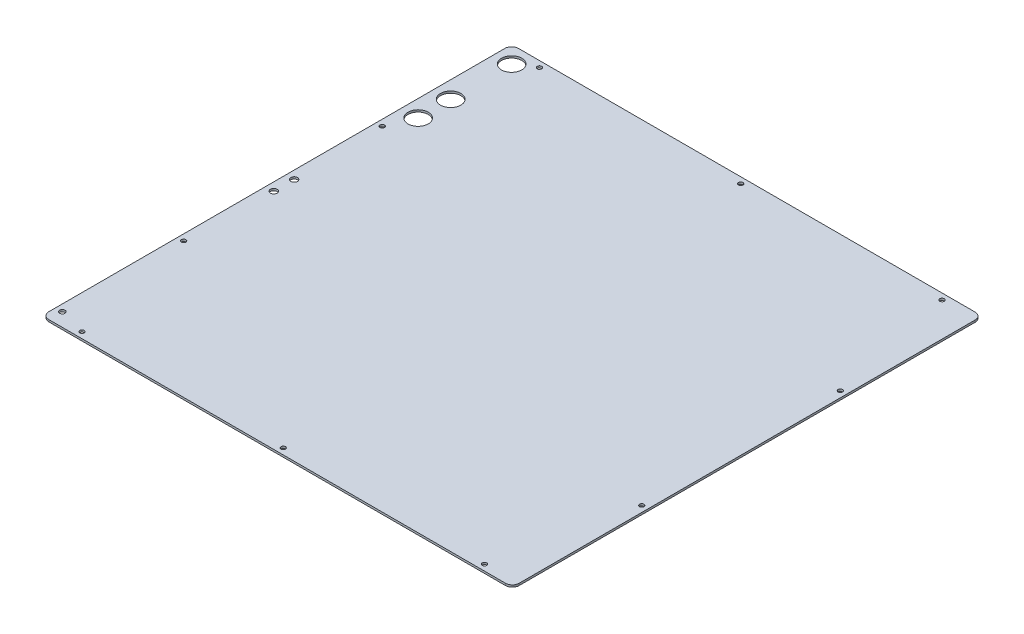
ISO-10303-21;
HEADER;
FILE_DESCRIPTION(('STEP AP214'),'2;1');
FILE_NAME('part.step','',(''),(''),'','','');
FILE_SCHEMA(('AUTOMOTIVE_DESIGN { 1 0 10303 214 1 1 1 1 }'));
ENDSEC;
DATA;
#1=APPLICATION_CONTEXT('core data for automotive mechanical design processes');
#2=APPLICATION_PROTOCOL_DEFINITION('international standard','automotive_design',2000,#1);
#3=PRODUCT_CONTEXT('',#1,'mechanical');
#4=PRODUCT('Part','Part','',(#3));
#5=PRODUCT_RELATED_PRODUCT_CATEGORY('part','',(#4));
#6=PRODUCT_DEFINITION_FORMATION('','',#4);
#7=PRODUCT_DEFINITION_CONTEXT('part definition',#1,'design');
#8=PRODUCT_DEFINITION('design','',#6,#7);
#9=PRODUCT_DEFINITION_SHAPE('','',#8);
#10=(LENGTH_UNIT() NAMED_UNIT(*) SI_UNIT(.MILLI.,.METRE.));
#11=(NAMED_UNIT(*) PLANE_ANGLE_UNIT() SI_UNIT($,.RADIAN.));
#12=(NAMED_UNIT(*) SI_UNIT($,.STERADIAN.) SOLID_ANGLE_UNIT());
#13=UNCERTAINTY_MEASURE_WITH_UNIT(LENGTH_MEASURE(1.E-05),#10,'distance_accuracy_value','');
#14=(GEOMETRIC_REPRESENTATION_CONTEXT(3) GLOBAL_UNCERTAINTY_ASSIGNED_CONTEXT((#13)) GLOBAL_UNIT_ASSIGNED_CONTEXT((#10,
#11,#12)) REPRESENTATION_CONTEXT('',''));
#15=CARTESIAN_POINT('',(0.,0.,0.));
#16=DIRECTION('',(0.,0.,1.));
#17=DIRECTION('',(1.,0.,0.));
#18=AXIS2_PLACEMENT_3D('',#15,#16,#17);
#19=CARTESIAN_POINT('',(-297.,3.,337.5));
#20=DIRECTION('',(0.,1.,0.));
#21=DIRECTION('',(0.,0.,1.));
#22=AXIS2_PLACEMENT_3D('',#19,#20,#21);
#23=CYLINDRICAL_SURFACE('',#22,3.3);
#24=CARTESIAN_POINT('',(-297.,0.,337.5));
#25=DIRECTION('',(0.,1.,0.));
#26=DIRECTION('',(0.,0.,1.));
#27=AXIS2_PLACEMENT_3D('',#24,#25,#26);
#28=CIRCLE('',#27,3.30000000000003);
#29=CARTESIAN_POINT('',(-297.,0.,340.8));
#30=VERTEX_POINT('',#29);
#31=EDGE_CURVE('E147',#30,#30,#28,.T.);
#32=ORIENTED_EDGE('',*,*,#31,.F.);
#33=EDGE_LOOP('',(#32));
#34=FACE_BOUND('',#33,.T.);
#35=CARTESIAN_POINT('',(-297.,3.,337.5));
#36=DIRECTION('',(0.,1.,0.));
#37=DIRECTION('',(0.,0.,1.));
#38=AXIS2_PLACEMENT_3D('',#35,#36,#37);
#39=CIRCLE('',#38,3.29999999999997);
#40=CARTESIAN_POINT('',(-297.,3.,340.8));
#41=VERTEX_POINT('',#40);
#42=EDGE_CURVE('E150',#41,#41,#39,.T.);
#43=ORIENTED_EDGE('',*,*,#42,.T.);
#44=EDGE_LOOP('',(#43));
#45=FACE_BOUND('',#44,.T.);
#46=ADVANCED_FACE('F36',(#34,#45),#23,.F.);
#47=CARTESIAN_POINT('',(-347.,3.,346.5));
#48=DIRECTION('',(1.,0.,0.));
#49=DIRECTION('',(0.,0.,-1.));
#50=AXIS2_PLACEMENT_3D('',#47,#48,#49);
#51=PLANE('',#50);
#52=DIRECTION('',(0.,0.,1.));
#53=VECTOR('',#52,1.);
#54=CARTESIAN_POINT('',(-347.,3.,346.5));
#55=LINE('',#54,#53);
#56=CARTESIAN_POINT('',(-347.,3.,-336.5));
#57=VERTEX_POINT('',#56);
#58=CARTESIAN_POINT('',(-347.,3.,336.5));
#59=VERTEX_POINT('',#58);
#60=EDGE_CURVE('E123',#57,#59,#55,.T.);
#61=ORIENTED_EDGE('',*,*,#60,.F.);
#62=DIRECTION('',(0.,-1.,0.));
#63=VECTOR('',#62,1.);
#64=CARTESIAN_POINT('',(-347.,3.,-336.5));
#65=LINE('',#64,#63);
#66=CARTESIAN_POINT('',(-347.,0.,-336.5));
#67=VERTEX_POINT('',#66);
#68=EDGE_CURVE('E107',#57,#67,#65,.T.);
#69=ORIENTED_EDGE('',*,*,#68,.T.);
#70=DIRECTION('',(0.,0.,1.));
#71=VECTOR('',#70,1.);
#72=CARTESIAN_POINT('',(-347.,0.,346.5));
#73=LINE('',#72,#71);
#74=CARTESIAN_POINT('',(-347.,0.,336.5));
#75=VERTEX_POINT('',#74);
#76=EDGE_CURVE('E120',#67,#75,#73,.T.);
#77=ORIENTED_EDGE('',*,*,#76,.T.);
#78=DIRECTION('',(0.,-1.,0.));
#79=VECTOR('',#78,1.);
#80=CARTESIAN_POINT('',(-347.,3.,336.5));
#81=LINE('',#80,#79);
#82=EDGE_CURVE('E125',#75,#59,#81,.F.);
#83=ORIENTED_EDGE('',*,*,#82,.T.);
#84=EDGE_LOOP('',(#61,#69,#77,#83));
#85=FACE_BOUND('',#84,.T.);
#86=ADVANCED_FACE('F119',(#85),#51,.F.);
#87=CARTESIAN_POINT('',(347.,3.,346.5));
#88=DIRECTION('',(0.,0.,-1.));
#89=DIRECTION('',(-1.,0.,0.));
#90=AXIS2_PLACEMENT_3D('',#87,#88,#89);
#91=PLANE('',#90);
#92=DIRECTION('',(1.,0.,0.));
#93=VECTOR('',#92,1.);
#94=CARTESIAN_POINT('',(347.,3.,346.5));
#95=LINE('',#94,#93);
#96=CARTESIAN_POINT('',(-337.,3.,346.5));
#97=VERTEX_POINT('',#96);
#98=CARTESIAN_POINT('',(337.,3.,346.5));
#99=VERTEX_POINT('',#98);
#100=EDGE_CURVE('E174',#97,#99,#95,.T.);
#101=ORIENTED_EDGE('',*,*,#100,.F.);
#102=DIRECTION('',(0.,-1.,0.));
#103=VECTOR('',#102,1.);
#104=CARTESIAN_POINT('',(-337.,3.,346.5));
#105=LINE('',#104,#103);
#106=CARTESIAN_POINT('',(-337.,0.,346.5));
#107=VERTEX_POINT('',#106);
#108=EDGE_CURVE('E11',#97,#107,#105,.T.);
#109=ORIENTED_EDGE('',*,*,#108,.T.);
#110=DIRECTION('',(1.,0.,0.));
#111=VECTOR('',#110,1.);
#112=CARTESIAN_POINT('',(347.,0.,346.5));
#113=LINE('',#112,#111);
#114=CARTESIAN_POINT('',(337.,0.,346.5));
#115=VERTEX_POINT('',#114);
#116=EDGE_CURVE('E131',#107,#115,#113,.T.);
#117=ORIENTED_EDGE('',*,*,#116,.T.);
#118=DIRECTION('',(0.,-1.,0.));
#119=VECTOR('',#118,1.);
#120=CARTESIAN_POINT('',(337.,3.,346.5));
#121=LINE('',#120,#119);
#122=EDGE_CURVE('E44',#115,#99,#121,.F.);
#123=ORIENTED_EDGE('',*,*,#122,.T.);
#124=EDGE_LOOP('',(#101,#109,#117,#123));
#125=FACE_BOUND('',#124,.T.);
#126=ADVANCED_FACE('F173',(#125),#91,.F.);
#127=CARTESIAN_POINT('',(347.,3.,346.5));
#128=DIRECTION('',(-1.,0.,0.));
#129=DIRECTION('',(0.,0.,1.));
#130=AXIS2_PLACEMENT_3D('',#127,#128,#129);
#131=PLANE('',#130);
#132=DIRECTION('',(0.,0.,-1.));
#133=VECTOR('',#132,1.);
#134=CARTESIAN_POINT('',(347.,0.,346.5));
#135=LINE('',#134,#133);
#136=CARTESIAN_POINT('',(347.,0.,336.5));
#137=VERTEX_POINT('',#136);
#138=CARTESIAN_POINT('',(347.,0.,-336.5));
#139=VERTEX_POINT('',#138);
#140=EDGE_CURVE('E135',#137,#139,#135,.T.);
#141=ORIENTED_EDGE('',*,*,#140,.T.);
#142=DIRECTION('',(0.,-1.,0.));
#143=VECTOR('',#142,1.);
#144=CARTESIAN_POINT('',(347.,3.,-336.5));
#145=LINE('',#144,#143);
#146=CARTESIAN_POINT('',(347.,3.,-336.5));
#147=VERTEX_POINT('',#146);
#148=EDGE_CURVE('E51',#139,#147,#145,.F.);
#149=ORIENTED_EDGE('',*,*,#148,.T.);
#150=DIRECTION('',(0.,0.,-1.));
#151=VECTOR('',#150,1.);
#152=CARTESIAN_POINT('',(347.,3.,346.5));
#153=LINE('',#152,#151);
#154=CARTESIAN_POINT('',(347.,3.,336.5));
#155=VERTEX_POINT('',#154);
#156=EDGE_CURVE('E181',#155,#147,#153,.T.);
#157=ORIENTED_EDGE('',*,*,#156,.F.);
#158=DIRECTION('',(0.,-1.,0.));
#159=VECTOR('',#158,1.);
#160=CARTESIAN_POINT('',(347.,3.,336.5));
#161=LINE('',#160,#159);
#162=EDGE_CURVE('E167',#155,#137,#161,.T.);
#163=ORIENTED_EDGE('',*,*,#162,.T.);
#164=EDGE_LOOP('',(#141,#149,#157,#163));
#165=FACE_BOUND('',#164,.T.);
#166=ADVANCED_FACE('F185',(#165),#131,.F.);
#167=CARTESIAN_POINT('',(347.,3.,-346.5));
#168=DIRECTION('',(0.,0.,1.));
#169=DIRECTION('',(1.,0.,0.));
#170=AXIS2_PLACEMENT_3D('',#167,#168,#169);
#171=PLANE('',#170);
#172=DIRECTION('',(-1.,0.,0.));
#173=VECTOR('',#172,1.);
#174=CARTESIAN_POINT('',(347.,0.,-346.5));
#175=LINE('',#174,#173);
#176=CARTESIAN_POINT('',(337.,0.,-346.5));
#177=VERTEX_POINT('',#176);
#178=CARTESIAN_POINT('',(-337.,0.,-346.5));
#179=VERTEX_POINT('',#178);
#180=EDGE_CURVE('E145',#177,#179,#175,.T.);
#181=ORIENTED_EDGE('',*,*,#180,.T.);
#182=DIRECTION('',(0.,-1.,0.));
#183=VECTOR('',#182,1.);
#184=CARTESIAN_POINT('',(-337.,3.,-346.5));
#185=LINE('',#184,#183);
#186=CARTESIAN_POINT('',(-337.,3.,-346.5));
#187=VERTEX_POINT('',#186);
#188=EDGE_CURVE('E108',#179,#187,#185,.F.);
#189=ORIENTED_EDGE('',*,*,#188,.T.);
#190=DIRECTION('',(-1.,0.,0.));
#191=VECTOR('',#190,1.);
#192=CARTESIAN_POINT('',(347.,3.,-346.5));
#193=LINE('',#192,#191);
#194=CARTESIAN_POINT('',(337.,3.,-346.5));
#195=VERTEX_POINT('',#194);
#196=EDGE_CURVE('E141',#195,#187,#193,.T.);
#197=ORIENTED_EDGE('',*,*,#196,.F.);
#198=DIRECTION('',(0.,-1.,0.));
#199=VECTOR('',#198,1.);
#200=CARTESIAN_POINT('',(337.,3.,-346.5));
#201=LINE('',#200,#199);
#202=EDGE_CURVE('E113',#195,#177,#201,.T.);
#203=ORIENTED_EDGE('',*,*,#202,.T.);
#204=EDGE_LOOP('',(#181,#189,#197,#203));
#205=FACE_BOUND('',#204,.T.);
#206=ADVANCED_FACE('F192',(#205),#171,.F.);
#207=CARTESIAN_POINT('',(0.,3.,0.));
#208=DIRECTION('',(0.,1.,0.));
#209=DIRECTION('',(0.,0.,1.));
#210=AXIS2_PLACEMENT_3D('',#207,#208,#209);
#211=PLANE('',#210);
#212=CARTESIAN_POINT('',(-337.,3.,326.5));
#213=DIRECTION('',(0.,1.,0.));
#214=DIRECTION('',(0.,0.,1.));
#215=AXIS2_PLACEMENT_3D('',#212,#213,#214);
#216=CIRCLE('',#215,3.99999999999999);
#217=CARTESIAN_POINT('',(-337.,3.,330.5));
#218=VERTEX_POINT('',#217);
#219=EDGE_CURVE('E276',#218,#218,#216,.T.);
#220=ORIENTED_EDGE('',*,*,#219,.F.);
#221=EDGE_LOOP('',(#220));
#222=FACE_BOUND('',#221,.T.);
#223=CARTESIAN_POINT('',(-335.,3.,16.5));
#224=DIRECTION('',(0.,1.,0.));
#225=DIRECTION('',(0.,0.,1.));
#226=AXIS2_PLACEMENT_3D('',#223,#224,#225);
#227=CIRCLE('',#226,4.99999999999999);
#228=CARTESIAN_POINT('',(-335.,3.,21.5));
#229=VERTEX_POINT('',#228);
#230=EDGE_CURVE('E270',#229,#229,#227,.T.);
#231=ORIENTED_EDGE('',*,*,#230,.F.);
#232=EDGE_LOOP('',(#231));
#233=FACE_BOUND('',#232,.T.);
#234=CARTESIAN_POINT('',(-335.,3.,-13.5));
#235=DIRECTION('',(0.,1.,0.));
#236=DIRECTION('',(0.,0.,1.));
#237=AXIS2_PLACEMENT_3D('',#234,#235,#236);
#238=CIRCLE('',#237,4.99999999999999);
#239=CARTESIAN_POINT('',(-335.,3.,-8.49999999999999));
#240=VERTEX_POINT('',#239);
#241=EDGE_CURVE('E264',#240,#240,#238,.T.);
#242=ORIENTED_EDGE('',*,*,#241,.F.);
#243=EDGE_LOOP('',(#242));
#244=FACE_BOUND('',#243,.T.);
#245=CARTESIAN_POINT('',(-322.,3.,-183.5));
#246=DIRECTION('',(0.,1.,0.));
#247=DIRECTION('',(0.,0.,1.));
#248=AXIS2_PLACEMENT_3D('',#245,#246,#247);
#249=CIRCLE('',#248,15.);
#250=CARTESIAN_POINT('',(-322.,3.,-168.5));
#251=VERTEX_POINT('',#250);
#252=EDGE_CURVE('E258',#251,#251,#249,.T.);
#253=ORIENTED_EDGE('',*,*,#252,.F.);
#254=EDGE_LOOP('',(#253));
#255=FACE_BOUND('',#254,.T.);
#256=CARTESIAN_POINT('',(-322.,3.,-231.5));
#257=DIRECTION('',(0.,1.,0.));
#258=DIRECTION('',(0.,0.,1.));
#259=AXIS2_PLACEMENT_3D('',#256,#257,#258);
#260=CIRCLE('',#259,15.);
#261=CARTESIAN_POINT('',(-322.,3.,-216.5));
#262=VERTEX_POINT('',#261);
#263=EDGE_CURVE('E252',#262,#262,#260,.T.);
#264=ORIENTED_EDGE('',*,*,#263,.F.);
#265=EDGE_LOOP('',(#264));
#266=FACE_BOUND('',#265,.T.);
#267=CARTESIAN_POINT('',(-322.,3.,-321.5));
#268=DIRECTION('',(0.,1.,0.));
#269=DIRECTION('',(0.,0.,1.));
#270=AXIS2_PLACEMENT_3D('',#267,#268,#269);
#271=CIRCLE('',#270,15.);
#272=CARTESIAN_POINT('',(-322.,3.,-306.5));
#273=VERTEX_POINT('',#272);
#274=EDGE_CURVE('E246',#273,#273,#271,.T.);
#275=ORIENTED_EDGE('',*,*,#274,.F.);
#276=EDGE_LOOP('',(#275));
#277=FACE_BOUND('',#276,.T.);
#278=CARTESIAN_POINT('',(-338.,3.,-146.5));
#279=DIRECTION('',(0.,1.,0.));
#280=DIRECTION('',(0.,0.,1.));
#281=AXIS2_PLACEMENT_3D('',#278,#279,#280);
#282=CIRCLE('',#281,3.29999999999997);
#283=CARTESIAN_POINT('',(-338.,3.,-143.2));
#284=VERTEX_POINT('',#283);
#285=EDGE_CURVE('E242',#284,#284,#282,.T.);
#286=ORIENTED_EDGE('',*,*,#285,.F.);
#287=EDGE_LOOP('',(#286));
#288=FACE_BOUND('',#287,.T.);
#289=CARTESIAN_POINT('',(-338.,3.,146.5));
#290=DIRECTION('',(0.,1.,0.));
#291=DIRECTION('',(0.,0.,1.));
#292=AXIS2_PLACEMENT_3D('',#289,#290,#291);
#293=CIRCLE('',#292,3.29999999999997);
#294=CARTESIAN_POINT('',(-338.,3.,149.8));
#295=VERTEX_POINT('',#294);
#296=EDGE_CURVE('E236',#295,#295,#293,.T.);
#297=ORIENTED_EDGE('',*,*,#296,.F.);
#298=EDGE_LOOP('',(#297));
#299=FACE_BOUND('',#298,.T.);
#300=CARTESIAN_POINT('',(338.,3.,-146.5));
#301=DIRECTION('',(0.,1.,0.));
#302=DIRECTION('',(0.,0.,1.));
#303=AXIS2_PLACEMENT_3D('',#300,#301,#302);
#304=CIRCLE('',#303,3.29999999999997);
#305=CARTESIAN_POINT('',(338.,3.,-143.2));
#306=VERTEX_POINT('',#305);
#307=EDGE_CURVE('E227',#306,#306,#304,.T.);
#308=ORIENTED_EDGE('',*,*,#307,.F.);
#309=EDGE_LOOP('',(#308));
#310=FACE_BOUND('',#309,.T.);
#311=CARTESIAN_POINT('',(338.,3.,146.5));
#312=DIRECTION('',(0.,1.,0.));
#313=DIRECTION('',(0.,0.,1.));
#314=AXIS2_PLACEMENT_3D('',#311,#312,#313);
#315=CIRCLE('',#314,3.29999999999997);
#316=CARTESIAN_POINT('',(338.,3.,149.8));
#317=VERTEX_POINT('',#316);
#318=EDGE_CURVE('E224',#317,#317,#315,.T.);
#319=ORIENTED_EDGE('',*,*,#318,.F.);
#320=EDGE_LOOP('',(#319));
#321=FACE_BOUND('',#320,.T.);
#322=CARTESIAN_POINT('',(-297.,3.,-337.5));
#323=DIRECTION('',(0.,1.,0.));
#324=DIRECTION('',(0.,0.,1.));
#325=AXIS2_PLACEMENT_3D('',#322,#323,#324);
#326=CIRCLE('',#325,3.29999999999997);
#327=CARTESIAN_POINT('',(-297.,3.,-334.2));
#328=VERTEX_POINT('',#327);
#329=EDGE_CURVE('E218',#328,#328,#326,.T.);
#330=ORIENTED_EDGE('',*,*,#329,.F.);
#331=EDGE_LOOP('',(#330));
#332=FACE_BOUND('',#331,.T.);
#333=CARTESIAN_POINT('',(0.,3.,-337.5));
#334=DIRECTION('',(0.,1.,0.));
#335=DIRECTION('',(0.,0.,1.));
#336=AXIS2_PLACEMENT_3D('',#333,#334,#335);
#337=CIRCLE('',#336,3.29999999999999);
#338=CARTESIAN_POINT('',(0.,3.,-334.2));
#339=VERTEX_POINT('',#338);
#340=EDGE_CURVE('E212',#339,#339,#337,.T.);
#341=ORIENTED_EDGE('',*,*,#340,.F.);
#342=EDGE_LOOP('',(#341));
#343=FACE_BOUND('',#342,.T.);
#344=CARTESIAN_POINT('',(297.,3.,-337.5));
#345=DIRECTION('',(0.,1.,0.));
#346=DIRECTION('',(0.,0.,1.));
#347=AXIS2_PLACEMENT_3D('',#344,#345,#346);
#348=CIRCLE('',#347,3.29999999999997);
#349=CARTESIAN_POINT('',(297.,3.,-334.2));
#350=VERTEX_POINT('',#349);
#351=EDGE_CURVE('E206',#350,#350,#348,.T.);
#352=ORIENTED_EDGE('',*,*,#351,.F.);
#353=EDGE_LOOP('',(#352));
#354=FACE_BOUND('',#353,.T.);
#355=CARTESIAN_POINT('',(0.,3.,337.5));
#356=DIRECTION('',(0.,1.,0.));
#357=DIRECTION('',(0.,0.,1.));
#358=AXIS2_PLACEMENT_3D('',#355,#356,#357);
#359=CIRCLE('',#358,3.29999999999997);
#360=CARTESIAN_POINT('',(0.,3.,340.8));
#361=VERTEX_POINT('',#360);
#362=EDGE_CURVE('E197',#361,#361,#359,.T.);
#363=ORIENTED_EDGE('',*,*,#362,.F.);
#364=EDGE_LOOP('',(#363));
#365=FACE_BOUND('',#364,.T.);
#366=CARTESIAN_POINT('',(297.,3.,337.5));
#367=DIRECTION('',(0.,1.,0.));
#368=DIRECTION('',(0.,0.,1.));
#369=AXIS2_PLACEMENT_3D('',#366,#367,#368);
#370=CIRCLE('',#369,3.29999999999997);
#371=CARTESIAN_POINT('',(297.,3.,340.8));
#372=VERTEX_POINT('',#371);
#373=EDGE_CURVE('E138',#372,#372,#370,.T.);
#374=ORIENTED_EDGE('',*,*,#373,.F.);
#375=EDGE_LOOP('',(#374));
#376=FACE_BOUND('',#375,.T.);
#377=ORIENTED_EDGE('',*,*,#196,.T.);
#378=CARTESIAN_POINT('',(-337.,3.,-336.5));
#379=DIRECTION('',(0.,1.,0.));
#380=DIRECTION('',(0.,0.,1.));
#381=AXIS2_PLACEMENT_3D('',#378,#379,#380);
#382=CIRCLE('',#381,10.);
#383=EDGE_CURVE('E165',#187,#57,#382,.T.);
#384=ORIENTED_EDGE('',*,*,#383,.T.);
#385=ORIENTED_EDGE('',*,*,#60,.T.);
#386=CARTESIAN_POINT('',(-337.,3.,336.5));
#387=DIRECTION('',(0.,1.,0.));
#388=DIRECTION('',(0.,0.,1.));
#389=AXIS2_PLACEMENT_3D('',#386,#387,#388);
#390=CIRCLE('',#389,10.);
#391=EDGE_CURVE('E161',#59,#97,#390,.T.);
#392=ORIENTED_EDGE('',*,*,#391,.T.);
#393=ORIENTED_EDGE('',*,*,#100,.T.);
#394=CARTESIAN_POINT('',(337.,3.,336.5));
#395=DIRECTION('',(0.,1.,0.));
#396=DIRECTION('',(0.,0.,1.));
#397=AXIS2_PLACEMENT_3D('',#394,#395,#396);
#398=CIRCLE('',#397,10.);
#399=EDGE_CURVE('E58',#99,#155,#398,.T.);
#400=ORIENTED_EDGE('',*,*,#399,.T.);
#401=ORIENTED_EDGE('',*,*,#156,.T.);
#402=CARTESIAN_POINT('',(337.,3.,-336.5));
#403=DIRECTION('',(0.,1.,0.));
#404=DIRECTION('',(0.,0.,1.));
#405=AXIS2_PLACEMENT_3D('',#402,#403,#404);
#406=CIRCLE('',#405,10.);
#407=EDGE_CURVE('E163',#147,#195,#406,.T.);
#408=ORIENTED_EDGE('',*,*,#407,.T.);
#409=EDGE_LOOP('',(#377,#384,#385,#392,#393,#400,#401,#408));
#410=FACE_BOUND('',#409,.T.);
#411=ORIENTED_EDGE('',*,*,#42,.F.);
#412=EDGE_LOOP('',(#411));
#413=FACE_BOUND('',#412,.T.);
#414=ADVANCED_FACE('F178',(#222,#233,#244,#255,#266,#277,#288,#299,#310,#321,#332,#343,#354,
#365,#376,#410,#413),#211,.T.);
#415=CARTESIAN_POINT('',(0.,0.,0.));
#416=DIRECTION('',(0.,1.,0.));
#417=DIRECTION('',(0.,0.,1.));
#418=AXIS2_PLACEMENT_3D('',#415,#416,#417);
#419=PLANE('',#418);
#420=CARTESIAN_POINT('',(-337.,0.,326.5));
#421=DIRECTION('',(0.,1.,0.));
#422=DIRECTION('',(0.,0.,1.));
#423=AXIS2_PLACEMENT_3D('',#420,#421,#422);
#424=CIRCLE('',#423,3.99999999999999);
#425=CARTESIAN_POINT('',(-337.,0.,330.5));
#426=VERTEX_POINT('',#425);
#427=EDGE_CURVE('E245',#426,#426,#424,.T.);
#428=ORIENTED_EDGE('',*,*,#427,.T.);
#429=EDGE_LOOP('',(#428));
#430=FACE_BOUND('',#429,.T.);
#431=CARTESIAN_POINT('',(-335.,0.,16.5));
#432=DIRECTION('',(0.,1.,0.));
#433=DIRECTION('',(0.,0.,1.));
#434=AXIS2_PLACEMENT_3D('',#431,#432,#433);
#435=CIRCLE('',#434,4.99999999999999);
#436=CARTESIAN_POINT('',(-335.,0.,21.5));
#437=VERTEX_POINT('',#436);
#438=EDGE_CURVE('E273',#437,#437,#435,.T.);
#439=ORIENTED_EDGE('',*,*,#438,.T.);
#440=EDGE_LOOP('',(#439));
#441=FACE_BOUND('',#440,.T.);
#442=CARTESIAN_POINT('',(-335.,0.,-13.5));
#443=DIRECTION('',(0.,1.,0.));
#444=DIRECTION('',(0.,0.,1.));
#445=AXIS2_PLACEMENT_3D('',#442,#443,#444);
#446=CIRCLE('',#445,4.99999999999999);
#447=CARTESIAN_POINT('',(-335.,0.,-8.49999999999999));
#448=VERTEX_POINT('',#447);
#449=EDGE_CURVE('E267',#448,#448,#446,.T.);
#450=ORIENTED_EDGE('',*,*,#449,.T.);
#451=EDGE_LOOP('',(#450));
#452=FACE_BOUND('',#451,.T.);
#453=CARTESIAN_POINT('',(-322.,0.,-183.5));
#454=DIRECTION('',(0.,1.,0.));
#455=DIRECTION('',(0.,0.,1.));
#456=AXIS2_PLACEMENT_3D('',#453,#454,#455);
#457=CIRCLE('',#456,15.);
#458=CARTESIAN_POINT('',(-322.,0.,-168.5));
#459=VERTEX_POINT('',#458);
#460=EDGE_CURVE('E261',#459,#459,#457,.T.);
#461=ORIENTED_EDGE('',*,*,#460,.T.);
#462=EDGE_LOOP('',(#461));
#463=FACE_BOUND('',#462,.T.);
#464=CARTESIAN_POINT('',(-322.,0.,-231.5));
#465=DIRECTION('',(0.,1.,0.));
#466=DIRECTION('',(0.,0.,1.));
#467=AXIS2_PLACEMENT_3D('',#464,#465,#466);
#468=CIRCLE('',#467,15.);
#469=CARTESIAN_POINT('',(-322.,0.,-216.5));
#470=VERTEX_POINT('',#469);
#471=EDGE_CURVE('E255',#470,#470,#468,.T.);
#472=ORIENTED_EDGE('',*,*,#471,.T.);
#473=EDGE_LOOP('',(#472));
#474=FACE_BOUND('',#473,.T.);
#475=CARTESIAN_POINT('',(-322.,0.,-321.5));
#476=DIRECTION('',(0.,1.,0.));
#477=DIRECTION('',(0.,0.,1.));
#478=AXIS2_PLACEMENT_3D('',#475,#476,#477);
#479=CIRCLE('',#478,15.);
#480=CARTESIAN_POINT('',(-322.,0.,-306.5));
#481=VERTEX_POINT('',#480);
#482=EDGE_CURVE('E249',#481,#481,#479,.T.);
#483=ORIENTED_EDGE('',*,*,#482,.T.);
#484=EDGE_LOOP('',(#483));
#485=FACE_BOUND('',#484,.T.);
#486=CARTESIAN_POINT('',(-338.,0.,-146.5));
#487=DIRECTION('',(0.,1.,0.));
#488=DIRECTION('',(0.,0.,1.));
#489=AXIS2_PLACEMENT_3D('',#486,#487,#488);
#490=CIRCLE('',#489,3.30000000000003);
#491=CARTESIAN_POINT('',(-338.,0.,-143.2));
#492=VERTEX_POINT('',#491);
#493=EDGE_CURVE('E239',#492,#492,#490,.T.);
#494=ORIENTED_EDGE('',*,*,#493,.T.);
#495=EDGE_LOOP('',(#494));
#496=FACE_BOUND('',#495,.T.);
#497=CARTESIAN_POINT('',(-338.,0.,146.5));
#498=DIRECTION('',(0.,1.,0.));
#499=DIRECTION('',(0.,0.,1.));
#500=AXIS2_PLACEMENT_3D('',#497,#498,#499);
#501=CIRCLE('',#500,3.30000000000003);
#502=CARTESIAN_POINT('',(-338.,0.,149.8));
#503=VERTEX_POINT('',#502);
#504=EDGE_CURVE('E233',#503,#503,#501,.T.);
#505=ORIENTED_EDGE('',*,*,#504,.T.);
#506=EDGE_LOOP('',(#505));
#507=FACE_BOUND('',#506,.T.);
#508=CARTESIAN_POINT('',(338.,0.,-146.5));
#509=DIRECTION('',(0.,1.,0.));
#510=DIRECTION('',(0.,0.,1.));
#511=AXIS2_PLACEMENT_3D('',#508,#509,#510);
#512=CIRCLE('',#511,3.30000000000003);
#513=CARTESIAN_POINT('',(338.,0.,-143.2));
#514=VERTEX_POINT('',#513);
#515=EDGE_CURVE('E230',#514,#514,#512,.T.);
#516=ORIENTED_EDGE('',*,*,#515,.T.);
#517=EDGE_LOOP('',(#516));
#518=FACE_BOUND('',#517,.T.);
#519=CARTESIAN_POINT('',(338.,0.,146.5));
#520=DIRECTION('',(0.,1.,0.));
#521=DIRECTION('',(0.,0.,1.));
#522=AXIS2_PLACEMENT_3D('',#519,#520,#521);
#523=CIRCLE('',#522,3.30000000000003);
#524=CARTESIAN_POINT('',(338.,0.,149.8));
#525=VERTEX_POINT('',#524);
#526=EDGE_CURVE('E221',#525,#525,#523,.T.);
#527=ORIENTED_EDGE('',*,*,#526,.T.);
#528=EDGE_LOOP('',(#527));
#529=FACE_BOUND('',#528,.T.);
#530=CARTESIAN_POINT('',(-297.,0.,-337.5));
#531=DIRECTION('',(0.,1.,0.));
#532=DIRECTION('',(0.,0.,1.));
#533=AXIS2_PLACEMENT_3D('',#530,#531,#532);
#534=CIRCLE('',#533,3.30000000000003);
#535=CARTESIAN_POINT('',(-297.,0.,-334.2));
#536=VERTEX_POINT('',#535);
#537=EDGE_CURVE('E215',#536,#536,#534,.T.);
#538=ORIENTED_EDGE('',*,*,#537,.T.);
#539=EDGE_LOOP('',(#538));
#540=FACE_BOUND('',#539,.T.);
#541=CARTESIAN_POINT('',(0.,0.,-337.5));
#542=DIRECTION('',(0.,1.,0.));
#543=DIRECTION('',(0.,0.,1.));
#544=AXIS2_PLACEMENT_3D('',#541,#542,#543);
#545=CIRCLE('',#544,3.3);
#546=CARTESIAN_POINT('',(0.,0.,-334.2));
#547=VERTEX_POINT('',#546);
#548=EDGE_CURVE('E209',#547,#547,#545,.T.);
#549=ORIENTED_EDGE('',*,*,#548,.T.);
#550=EDGE_LOOP('',(#549));
#551=FACE_BOUND('',#550,.T.);
#552=CARTESIAN_POINT('',(297.,0.,-337.5));
#553=DIRECTION('',(0.,1.,0.));
#554=DIRECTION('',(0.,0.,1.));
#555=AXIS2_PLACEMENT_3D('',#552,#553,#554);
#556=CIRCLE('',#555,3.30000000000003);
#557=CARTESIAN_POINT('',(297.,0.,-334.2));
#558=VERTEX_POINT('',#557);
#559=EDGE_CURVE('E203',#558,#558,#556,.T.);
#560=ORIENTED_EDGE('',*,*,#559,.T.);
#561=EDGE_LOOP('',(#560));
#562=FACE_BOUND('',#561,.T.);
#563=CARTESIAN_POINT('',(0.,0.,337.5));
#564=DIRECTION('',(0.,1.,0.));
#565=DIRECTION('',(0.,0.,1.));
#566=AXIS2_PLACEMENT_3D('',#563,#564,#565);
#567=CIRCLE('',#566,3.30000000000003);
#568=CARTESIAN_POINT('',(0.,0.,340.8));
#569=VERTEX_POINT('',#568);
#570=EDGE_CURVE('E200',#569,#569,#567,.T.);
#571=ORIENTED_EDGE('',*,*,#570,.T.);
#572=EDGE_LOOP('',(#571));
#573=FACE_BOUND('',#572,.T.);
#574=CARTESIAN_POINT('',(297.,0.,337.5));
#575=DIRECTION('',(0.,1.,0.));
#576=DIRECTION('',(0.,0.,1.));
#577=AXIS2_PLACEMENT_3D('',#574,#575,#576);
#578=CIRCLE('',#577,3.30000000000003);
#579=CARTESIAN_POINT('',(297.,0.,340.8));
#580=VERTEX_POINT('',#579);
#581=EDGE_CURVE('E132',#580,#580,#578,.T.);
#582=ORIENTED_EDGE('',*,*,#581,.T.);
#583=EDGE_LOOP('',(#582));
#584=FACE_BOUND('',#583,.T.);
#585=ORIENTED_EDGE('',*,*,#76,.F.);
#586=CARTESIAN_POINT('',(-337.,0.,-336.5));
#587=DIRECTION('',(0.,1.,0.));
#588=DIRECTION('',(0.,0.,1.));
#589=AXIS2_PLACEMENT_3D('',#586,#587,#588);
#590=CIRCLE('',#589,10.);
#591=EDGE_CURVE('E103',#67,#179,#590,.F.);
#592=ORIENTED_EDGE('',*,*,#591,.T.);
#593=ORIENTED_EDGE('',*,*,#180,.F.);
#594=CARTESIAN_POINT('',(337.,0.,-336.5));
#595=DIRECTION('',(0.,1.,0.));
#596=DIRECTION('',(0.,0.,1.));
#597=AXIS2_PLACEMENT_3D('',#594,#595,#596);
#598=CIRCLE('',#597,10.);
#599=EDGE_CURVE('E114',#177,#139,#598,.F.);
#600=ORIENTED_EDGE('',*,*,#599,.T.);
#601=ORIENTED_EDGE('',*,*,#140,.F.);
#602=CARTESIAN_POINT('',(337.,0.,336.5));
#603=DIRECTION('',(0.,1.,0.));
#604=DIRECTION('',(0.,0.,1.));
#605=AXIS2_PLACEMENT_3D('',#602,#603,#604);
#606=CIRCLE('',#605,10.);
#607=EDGE_CURVE('E124',#137,#115,#606,.F.);
#608=ORIENTED_EDGE('',*,*,#607,.T.);
#609=ORIENTED_EDGE('',*,*,#116,.F.);
#610=CARTESIAN_POINT('',(-337.,0.,336.5));
#611=DIRECTION('',(0.,1.,0.));
#612=DIRECTION('',(0.,0.,1.));
#613=AXIS2_PLACEMENT_3D('',#610,#611,#612);
#614=CIRCLE('',#613,10.);
#615=EDGE_CURVE('E130',#107,#75,#614,.F.);
#616=ORIENTED_EDGE('',*,*,#615,.T.);
#617=EDGE_LOOP('',(#585,#592,#593,#600,#601,#608,#609,#616));
#618=FACE_BOUND('',#617,.T.);
#619=ORIENTED_EDGE('',*,*,#31,.T.);
#620=EDGE_LOOP('',(#619));
#621=FACE_BOUND('',#620,.T.);
#622=ADVANCED_FACE('F127',(#430,#441,#452,#463,#474,#485,#496,#507,#518,#529,#540,#551,#562,
#573,#584,#618,#621),#419,.F.);
#623=CARTESIAN_POINT('',(297.,3.,337.5));
#624=DIRECTION('',(0.,1.,0.));
#625=DIRECTION('',(0.,0.,1.));
#626=AXIS2_PLACEMENT_3D('',#623,#624,#625);
#627=CYLINDRICAL_SURFACE('',#626,3.3);
#628=ORIENTED_EDGE('',*,*,#581,.F.);
#629=EDGE_LOOP('',(#628));
#630=FACE_BOUND('',#629,.T.);
#631=ORIENTED_EDGE('',*,*,#373,.T.);
#632=EDGE_LOOP('',(#631));
#633=FACE_BOUND('',#632,.T.);
#634=ADVANCED_FACE('F322',(#630,#633),#627,.F.);
#635=CARTESIAN_POINT('',(0.,3.,337.5));
#636=DIRECTION('',(0.,1.,0.));
#637=DIRECTION('',(0.,0.,1.));
#638=AXIS2_PLACEMENT_3D('',#635,#636,#637);
#639=CYLINDRICAL_SURFACE('',#638,3.3);
#640=ORIENTED_EDGE('',*,*,#570,.F.);
#641=EDGE_LOOP('',(#640));
#642=FACE_BOUND('',#641,.T.);
#643=ORIENTED_EDGE('',*,*,#362,.T.);
#644=EDGE_LOOP('',(#643));
#645=FACE_BOUND('',#644,.T.);
#646=ADVANCED_FACE('F324',(#642,#645),#639,.F.);
#647=CARTESIAN_POINT('',(297.,3.,-337.5));
#648=DIRECTION('',(0.,1.,0.));
#649=DIRECTION('',(0.,0.,1.));
#650=AXIS2_PLACEMENT_3D('',#647,#648,#649);
#651=CYLINDRICAL_SURFACE('',#650,3.3);
#652=ORIENTED_EDGE('',*,*,#559,.F.);
#653=EDGE_LOOP('',(#652));
#654=FACE_BOUND('',#653,.T.);
#655=ORIENTED_EDGE('',*,*,#351,.T.);
#656=EDGE_LOOP('',(#655));
#657=FACE_BOUND('',#656,.T.);
#658=ADVANCED_FACE('F331',(#654,#657),#651,.F.);
#659=CARTESIAN_POINT('',(0.,3.,-337.5));
#660=DIRECTION('',(0.,1.,0.));
#661=DIRECTION('',(0.,0.,1.));
#662=AXIS2_PLACEMENT_3D('',#659,#660,#661);
#663=CYLINDRICAL_SURFACE('',#662,3.29999999999999);
#664=ORIENTED_EDGE('',*,*,#548,.F.);
#665=EDGE_LOOP('',(#664));
#666=FACE_BOUND('',#665,.T.);
#667=ORIENTED_EDGE('',*,*,#340,.T.);
#668=EDGE_LOOP('',(#667));
#669=FACE_BOUND('',#668,.T.);
#670=ADVANCED_FACE('F392',(#666,#669),#663,.F.);
#671=CARTESIAN_POINT('',(-297.,3.,-337.5));
#672=DIRECTION('',(0.,1.,0.));
#673=DIRECTION('',(0.,0.,1.));
#674=AXIS2_PLACEMENT_3D('',#671,#672,#673);
#675=CYLINDRICAL_SURFACE('',#674,3.3);
#676=ORIENTED_EDGE('',*,*,#537,.F.);
#677=EDGE_LOOP('',(#676));
#678=FACE_BOUND('',#677,.T.);
#679=ORIENTED_EDGE('',*,*,#329,.T.);
#680=EDGE_LOOP('',(#679));
#681=FACE_BOUND('',#680,.T.);
#682=ADVANCED_FACE('F388',(#678,#681),#675,.F.);
#683=CARTESIAN_POINT('',(338.,3.,146.5));
#684=DIRECTION('',(0.,1.,0.));
#685=DIRECTION('',(0.,0.,1.));
#686=AXIS2_PLACEMENT_3D('',#683,#684,#685);
#687=CYLINDRICAL_SURFACE('',#686,3.3);
#688=ORIENTED_EDGE('',*,*,#526,.F.);
#689=EDGE_LOOP('',(#688));
#690=FACE_BOUND('',#689,.T.);
#691=ORIENTED_EDGE('',*,*,#318,.T.);
#692=EDGE_LOOP('',(#691));
#693=FACE_BOUND('',#692,.T.);
#694=ADVANCED_FACE('F384',(#690,#693),#687,.F.);
#695=CARTESIAN_POINT('',(338.,3.,-146.5));
#696=DIRECTION('',(0.,1.,0.));
#697=DIRECTION('',(0.,0.,1.));
#698=AXIS2_PLACEMENT_3D('',#695,#696,#697);
#699=CYLINDRICAL_SURFACE('',#698,3.3);
#700=ORIENTED_EDGE('',*,*,#515,.F.);
#701=EDGE_LOOP('',(#700));
#702=FACE_BOUND('',#701,.T.);
#703=ORIENTED_EDGE('',*,*,#307,.T.);
#704=EDGE_LOOP('',(#703));
#705=FACE_BOUND('',#704,.T.);
#706=ADVANCED_FACE('F380',(#702,#705),#699,.F.);
#707=CARTESIAN_POINT('',(-338.,3.,146.5));
#708=DIRECTION('',(0.,1.,0.));
#709=DIRECTION('',(0.,0.,1.));
#710=AXIS2_PLACEMENT_3D('',#707,#708,#709);
#711=CYLINDRICAL_SURFACE('',#710,3.3);
#712=ORIENTED_EDGE('',*,*,#504,.F.);
#713=EDGE_LOOP('',(#712));
#714=FACE_BOUND('',#713,.T.);
#715=ORIENTED_EDGE('',*,*,#296,.T.);
#716=EDGE_LOOP('',(#715));
#717=FACE_BOUND('',#716,.T.);
#718=ADVANCED_FACE('F376',(#714,#717),#711,.F.);
#719=CARTESIAN_POINT('',(-338.,3.,-146.5));
#720=DIRECTION('',(0.,1.,0.));
#721=DIRECTION('',(0.,0.,1.));
#722=AXIS2_PLACEMENT_3D('',#719,#720,#721);
#723=CYLINDRICAL_SURFACE('',#722,3.3);
#724=ORIENTED_EDGE('',*,*,#493,.F.);
#725=EDGE_LOOP('',(#724));
#726=FACE_BOUND('',#725,.T.);
#727=ORIENTED_EDGE('',*,*,#285,.T.);
#728=EDGE_LOOP('',(#727));
#729=FACE_BOUND('',#728,.T.);
#730=ADVANCED_FACE('F349',(#726,#729),#723,.F.);
#731=CARTESIAN_POINT('',(-337.,3.,-336.5));
#732=DIRECTION('',(0.,-1.,0.));
#733=DIRECTION('',(0.,0.,-1.));
#734=AXIS2_PLACEMENT_3D('',#731,#732,#733);
#735=CYLINDRICAL_SURFACE('',#734,10.);
#736=ORIENTED_EDGE('',*,*,#383,.F.);
#737=ORIENTED_EDGE('',*,*,#188,.F.);
#738=ORIENTED_EDGE('',*,*,#591,.F.);
#739=ORIENTED_EDGE('',*,*,#68,.F.);
#740=EDGE_LOOP('',(#736,#737,#738,#739));
#741=FACE_BOUND('',#740,.T.);
#742=ADVANCED_FACE('F106',(#741),#735,.T.);
#743=CARTESIAN_POINT('',(337.,3.,-336.5));
#744=DIRECTION('',(0.,-1.,0.));
#745=DIRECTION('',(0.,0.,-1.));
#746=AXIS2_PLACEMENT_3D('',#743,#744,#745);
#747=CYLINDRICAL_SURFACE('',#746,10.);
#748=ORIENTED_EDGE('',*,*,#407,.F.);
#749=ORIENTED_EDGE('',*,*,#148,.F.);
#750=ORIENTED_EDGE('',*,*,#599,.F.);
#751=ORIENTED_EDGE('',*,*,#202,.F.);
#752=EDGE_LOOP('',(#748,#749,#750,#751));
#753=FACE_BOUND('',#752,.T.);
#754=ADVANCED_FACE('F189',(#753),#747,.T.);
#755=CARTESIAN_POINT('',(-337.,3.,336.5));
#756=DIRECTION('',(0.,-1.,0.));
#757=DIRECTION('',(0.,0.,-1.));
#758=AXIS2_PLACEMENT_3D('',#755,#756,#757);
#759=CYLINDRICAL_SURFACE('',#758,10.);
#760=ORIENTED_EDGE('',*,*,#391,.F.);
#761=ORIENTED_EDGE('',*,*,#82,.F.);
#762=ORIENTED_EDGE('',*,*,#615,.F.);
#763=ORIENTED_EDGE('',*,*,#108,.F.);
#764=EDGE_LOOP('',(#760,#761,#762,#763));
#765=FACE_BOUND('',#764,.T.);
#766=ADVANCED_FACE('F351',(#765),#759,.T.);
#767=CARTESIAN_POINT('',(337.,3.,336.5));
#768=DIRECTION('',(0.,-1.,0.));
#769=DIRECTION('',(0.,0.,-1.));
#770=AXIS2_PLACEMENT_3D('',#767,#768,#769);
#771=CYLINDRICAL_SURFACE('',#770,10.);
#772=ORIENTED_EDGE('',*,*,#399,.F.);
#773=ORIENTED_EDGE('',*,*,#122,.F.);
#774=ORIENTED_EDGE('',*,*,#607,.F.);
#775=ORIENTED_EDGE('',*,*,#162,.F.);
#776=EDGE_LOOP('',(#772,#773,#774,#775));
#777=FACE_BOUND('',#776,.T.);
#778=ADVANCED_FACE('F38',(#777),#771,.T.);
#779=CARTESIAN_POINT('',(-322.,0.,-321.5));
#780=DIRECTION('',(0.,1.,0.));
#781=DIRECTION('',(0.,0.,1.));
#782=AXIS2_PLACEMENT_3D('',#779,#780,#781);
#783=CYLINDRICAL_SURFACE('',#782,15.);
#784=ORIENTED_EDGE('',*,*,#482,.F.);
#785=EDGE_LOOP('',(#784));
#786=FACE_BOUND('',#785,.T.);
#787=ORIENTED_EDGE('',*,*,#274,.T.);
#788=EDGE_LOOP('',(#787));
#789=FACE_BOUND('',#788,.T.);
#790=ADVANCED_FACE('F357',(#786,#789),#783,.F.);
#791=CARTESIAN_POINT('',(-322.,0.,-231.5));
#792=DIRECTION('',(0.,1.,0.));
#793=DIRECTION('',(0.,0.,1.));
#794=AXIS2_PLACEMENT_3D('',#791,#792,#793);
#795=CYLINDRICAL_SURFACE('',#794,15.);
#796=ORIENTED_EDGE('',*,*,#471,.F.);
#797=EDGE_LOOP('',(#796));
#798=FACE_BOUND('',#797,.T.);
#799=ORIENTED_EDGE('',*,*,#263,.T.);
#800=EDGE_LOOP('',(#799));
#801=FACE_BOUND('',#800,.T.);
#802=ADVANCED_FACE('F361',(#798,#801),#795,.F.);
#803=CARTESIAN_POINT('',(-322.,0.,-183.5));
#804=DIRECTION('',(0.,1.,0.));
#805=DIRECTION('',(0.,0.,1.));
#806=AXIS2_PLACEMENT_3D('',#803,#804,#805);
#807=CYLINDRICAL_SURFACE('',#806,15.);
#808=ORIENTED_EDGE('',*,*,#460,.F.);
#809=EDGE_LOOP('',(#808));
#810=FACE_BOUND('',#809,.T.);
#811=ORIENTED_EDGE('',*,*,#252,.T.);
#812=EDGE_LOOP('',(#811));
#813=FACE_BOUND('',#812,.T.);
#814=ADVANCED_FACE('F367',(#810,#813),#807,.F.);
#815=CARTESIAN_POINT('',(-335.,0.,-13.5));
#816=DIRECTION('',(0.,1.,0.));
#817=DIRECTION('',(0.,0.,1.));
#818=AXIS2_PLACEMENT_3D('',#815,#816,#817);
#819=CYLINDRICAL_SURFACE('',#818,4.99999999999999);
#820=ORIENTED_EDGE('',*,*,#449,.F.);
#821=EDGE_LOOP('',(#820));
#822=FACE_BOUND('',#821,.T.);
#823=ORIENTED_EDGE('',*,*,#241,.T.);
#824=EDGE_LOOP('',(#823));
#825=FACE_BOUND('',#824,.T.);
#826=ADVANCED_FACE('F469',(#822,#825),#819,.F.);
#827=CARTESIAN_POINT('',(-335.,0.,16.5));
#828=DIRECTION('',(0.,1.,0.));
#829=DIRECTION('',(0.,0.,1.));
#830=AXIS2_PLACEMENT_3D('',#827,#828,#829);
#831=CYLINDRICAL_SURFACE('',#830,4.99999999999999);
#832=ORIENTED_EDGE('',*,*,#438,.F.);
#833=EDGE_LOOP('',(#832));
#834=FACE_BOUND('',#833,.T.);
#835=ORIENTED_EDGE('',*,*,#230,.T.);
#836=EDGE_LOOP('',(#835));
#837=FACE_BOUND('',#836,.T.);
#838=ADVANCED_FACE('F287',(#834,#837),#831,.F.);
#839=CARTESIAN_POINT('',(-337.,0.,326.5));
#840=DIRECTION('',(0.,1.,0.));
#841=DIRECTION('',(0.,0.,1.));
#842=AXIS2_PLACEMENT_3D('',#839,#840,#841);
#843=CYLINDRICAL_SURFACE('',#842,3.99999999999999);
#844=ORIENTED_EDGE('',*,*,#427,.F.);
#845=EDGE_LOOP('',(#844));
#846=FACE_BOUND('',#845,.T.);
#847=ORIENTED_EDGE('',*,*,#219,.T.);
#848=EDGE_LOOP('',(#847));
#849=FACE_BOUND('',#848,.T.);
#850=ADVANCED_FACE('F284',(#846,#849),#843,.F.);
#851=CLOSED_SHELL('',(#46,#86,#126,#166,#206,#414,#622,#634,#646,#658,#670,#682,#694,#706,#718,
#730,#742,#754,#766,#778,#790,#802,#814,#826,#838,#850));
#852=MANIFOLD_SOLID_BREP('B2',#851);
#853=ADVANCED_BREP_SHAPE_REPRESENTATION('',(#18,#852),#14);
#854=SHAPE_DEFINITION_REPRESENTATION(#9,#853);
ENDSEC;
END-ISO-10303-21;
